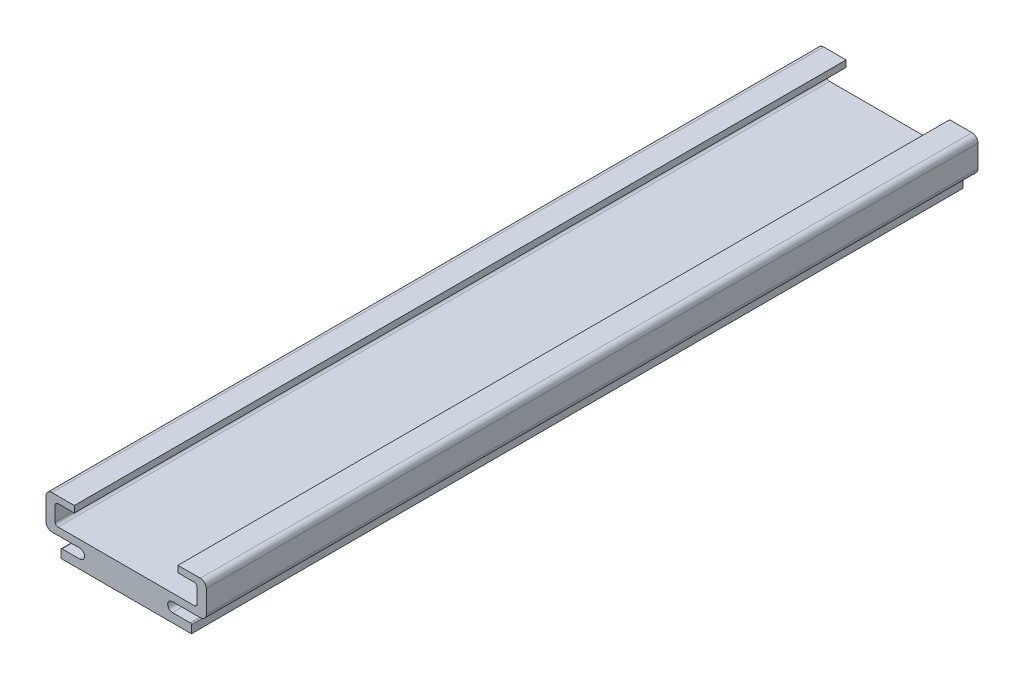
ISO-10303-21;
HEADER;
FILE_DESCRIPTION(('STEP AP214'),'2;1');
FILE_NAME('part.step','',(''),(''),'','','');
FILE_SCHEMA(('AUTOMOTIVE_DESIGN { 1 0 10303 214 1 1 1 1 }'));
ENDSEC;
DATA;
#1=APPLICATION_CONTEXT('core data for automotive mechanical design processes');
#2=APPLICATION_PROTOCOL_DEFINITION('international standard','automotive_design',2000,#1);
#3=PRODUCT_CONTEXT('',#1,'mechanical');
#4=PRODUCT('Part','Part','',(#3));
#5=PRODUCT_RELATED_PRODUCT_CATEGORY('part','',(#4));
#6=PRODUCT_DEFINITION_FORMATION('','',#4);
#7=PRODUCT_DEFINITION_CONTEXT('part definition',#1,'design');
#8=PRODUCT_DEFINITION('design','',#6,#7);
#9=PRODUCT_DEFINITION_SHAPE('','',#8);
#10=(LENGTH_UNIT() NAMED_UNIT(*) SI_UNIT(.MILLI.,.METRE.));
#11=(NAMED_UNIT(*) PLANE_ANGLE_UNIT() SI_UNIT($,.RADIAN.));
#12=(NAMED_UNIT(*) SI_UNIT($,.STERADIAN.) SOLID_ANGLE_UNIT());
#13=UNCERTAINTY_MEASURE_WITH_UNIT(LENGTH_MEASURE(1.E-05),#10,'distance_accuracy_value','');
#14=(GEOMETRIC_REPRESENTATION_CONTEXT(3) GLOBAL_UNCERTAINTY_ASSIGNED_CONTEXT((#13)) GLOBAL_UNIT_ASSIGNED_CONTEXT((#10,
#11,#12)) REPRESENTATION_CONTEXT('',''));
#15=CARTESIAN_POINT('',(0.,0.,0.));
#16=DIRECTION('',(0.,0.,1.));
#17=DIRECTION('',(1.,0.,0.));
#18=AXIS2_PLACEMENT_3D('',#15,#16,#17);
#19=CARTESIAN_POINT('',(-10.8,1.3,0.));
#20=DIRECTION('',(0.,0.,-1.));
#21=DIRECTION('',(-1.,0.,0.));
#22=AXIS2_PLACEMENT_3D('',#19,#20,#21);
#23=CYLINDRICAL_SURFACE('',#22,0.2);
#24=CARTESIAN_POINT('',(-10.8,1.3,0.));
#25=DIRECTION('',(0.,0.,-1.));
#26=DIRECTION('',(-1.,0.,0.));
#27=AXIS2_PLACEMENT_3D('',#24,#25,#26);
#28=CIRCLE('',#27,0.2);
#29=CARTESIAN_POINT('',(-11.,1.3,0.));
#30=VERTEX_POINT('',#29);
#31=CARTESIAN_POINT('',(-10.8,1.5,0.));
#32=VERTEX_POINT('',#31);
#33=EDGE_CURVE('E294',#30,#32,#28,.T.);
#34=ORIENTED_EDGE('',*,*,#33,.T.);
#35=DIRECTION('',(0.,0.,1.));
#36=VECTOR('',#35,1.);
#37=CARTESIAN_POINT('',(-10.8,1.5,0.));
#38=LINE('',#37,#36);
#39=CARTESIAN_POINT('',(-10.8,1.5,-130.));
#40=VERTEX_POINT('',#39);
#41=EDGE_CURVE('E303',#40,#32,#38,.T.);
#42=ORIENTED_EDGE('',*,*,#41,.F.);
#43=CARTESIAN_POINT('',(-10.8,1.3,-130.));
#44=DIRECTION('',(0.,0.,-1.));
#45=DIRECTION('',(-1.,0.,0.));
#46=AXIS2_PLACEMENT_3D('',#43,#44,#45);
#47=CIRCLE('',#46,0.2);
#48=CARTESIAN_POINT('',(-11.,1.3,-130.));
#49=VERTEX_POINT('',#48);
#50=EDGE_CURVE('E20',#40,#49,#47,.F.);
#51=ORIENTED_EDGE('',*,*,#50,.T.);
#52=DIRECTION('',(0.,0.,1.));
#53=VECTOR('',#52,1.);
#54=CARTESIAN_POINT('',(-11.,1.3,0.));
#55=LINE('',#54,#53);
#56=EDGE_CURVE('E301',#30,#49,#55,.F.);
#57=ORIENTED_EDGE('',*,*,#56,.F.);
#58=EDGE_LOOP('',(#34,#42,#51,#57));
#59=FACE_BOUND('',#58,.T.);
#60=ADVANCED_FACE('F17',(#59),#23,.T.);
#61=CARTESIAN_POINT('',(11.,1.5,0.));
#62=DIRECTION('',(-1.,0.,0.));
#63=DIRECTION('',(0.,0.,1.));
#64=AXIS2_PLACEMENT_3D('',#61,#62,#63);
#65=PLANE('',#64);
#66=DIRECTION('',(0.,1.,0.));
#67=VECTOR('',#66,1.);
#68=CARTESIAN_POINT('',(11.,1.5,0.));
#69=LINE('',#68,#67);
#70=CARTESIAN_POINT('',(11.,0.,0.));
#71=VERTEX_POINT('',#70);
#72=CARTESIAN_POINT('',(11.,1.3,0.));
#73=VERTEX_POINT('',#72);
#74=EDGE_CURVE('E299',#71,#73,#69,.T.);
#75=ORIENTED_EDGE('',*,*,#74,.F.);
#76=DIRECTION('',(0.,0.,-1.));
#77=VECTOR('',#76,1.);
#78=CARTESIAN_POINT('',(11.,0.,0.));
#79=LINE('',#78,#77);
#80=CARTESIAN_POINT('',(11.,0.,-130.));
#81=VERTEX_POINT('',#80);
#82=EDGE_CURVE('E322',#81,#71,#79,.F.);
#83=ORIENTED_EDGE('',*,*,#82,.F.);
#84=DIRECTION('',(0.,1.,0.));
#85=VECTOR('',#84,1.);
#86=CARTESIAN_POINT('',(11.,1.5,-130.));
#87=LINE('',#86,#85);
#88=CARTESIAN_POINT('',(11.,1.3,-130.));
#89=VERTEX_POINT('',#88);
#90=EDGE_CURVE('E295',#89,#81,#87,.F.);
#91=ORIENTED_EDGE('',*,*,#90,.F.);
#92=DIRECTION('',(0.,0.,1.));
#93=VECTOR('',#92,1.);
#94=CARTESIAN_POINT('',(11.,1.3,0.));
#95=LINE('',#94,#93);
#96=EDGE_CURVE('E288',#73,#89,#95,.F.);
#97=ORIENTED_EDGE('',*,*,#96,.F.);
#98=EDGE_LOOP('',(#75,#83,#91,#97));
#99=FACE_BOUND('',#98,.T.);
#100=ADVANCED_FACE('F379',(#99),#65,.F.);
#101=CARTESIAN_POINT('',(-11.,1.5,0.));
#102=DIRECTION('',(-1.,0.,0.));
#103=DIRECTION('',(0.,0.,1.));
#104=AXIS2_PLACEMENT_3D('',#101,#102,#103);
#105=PLANE('',#104);
#106=DIRECTION('',(0.,0.,-1.));
#107=VECTOR('',#106,1.);
#108=CARTESIAN_POINT('',(-11.,0.,0.));
#109=LINE('',#108,#107);
#110=CARTESIAN_POINT('',(-11.,0.,0.));
#111=VERTEX_POINT('',#110);
#112=CARTESIAN_POINT('',(-11.,0.,-130.));
#113=VERTEX_POINT('',#112);
#114=EDGE_CURVE('E319',#111,#113,#109,.T.);
#115=ORIENTED_EDGE('',*,*,#114,.F.);
#116=DIRECTION('',(0.,1.,0.));
#117=VECTOR('',#116,1.);
#118=CARTESIAN_POINT('',(-11.,1.5,0.));
#119=LINE('',#118,#117);
#120=EDGE_CURVE('E293',#111,#30,#119,.T.);
#121=ORIENTED_EDGE('',*,*,#120,.T.);
#122=ORIENTED_EDGE('',*,*,#56,.T.);
#123=DIRECTION('',(0.,1.,0.));
#124=VECTOR('',#123,1.);
#125=CARTESIAN_POINT('',(-11.,1.5,-130.));
#126=LINE('',#125,#124);
#127=EDGE_CURVE('E191',#49,#113,#126,.F.);
#128=ORIENTED_EDGE('',*,*,#127,.T.);
#129=EDGE_LOOP('',(#115,#121,#122,#128));
#130=FACE_BOUND('',#129,.T.);
#131=ADVANCED_FACE('F309',(#130),#105,.T.);
#132=CARTESIAN_POINT('',(10.8,1.3,0.));
#133=DIRECTION('',(0.,0.,1.));
#134=DIRECTION('',(1.,0.,0.));
#135=AXIS2_PLACEMENT_3D('',#132,#133,#134);
#136=CYLINDRICAL_SURFACE('',#135,0.2);
#137=CARTESIAN_POINT('',(10.8,1.3,0.));
#138=DIRECTION('',(0.,0.,1.));
#139=DIRECTION('',(1.,0.,0.));
#140=AXIS2_PLACEMENT_3D('',#137,#138,#139);
#141=CIRCLE('',#140,0.2);
#142=CARTESIAN_POINT('',(10.8,1.5,0.));
#143=VERTEX_POINT('',#142);
#144=EDGE_CURVE('E289',#143,#73,#141,.F.);
#145=ORIENTED_EDGE('',*,*,#144,.T.);
#146=ORIENTED_EDGE('',*,*,#96,.T.);
#147=CARTESIAN_POINT('',(10.8,1.3,-130.));
#148=DIRECTION('',(0.,0.,1.));
#149=DIRECTION('',(1.,0.,0.));
#150=AXIS2_PLACEMENT_3D('',#147,#148,#149);
#151=CIRCLE('',#150,0.2);
#152=CARTESIAN_POINT('',(10.8,1.5,-130.));
#153=VERTEX_POINT('',#152);
#154=EDGE_CURVE('E292',#89,#153,#151,.T.);
#155=ORIENTED_EDGE('',*,*,#154,.T.);
#156=DIRECTION('',(0.,0.,1.));
#157=VECTOR('',#156,1.);
#158=CARTESIAN_POINT('',(10.8,1.5,0.));
#159=LINE('',#158,#157);
#160=EDGE_CURVE('E321',#153,#143,#159,.T.);
#161=ORIENTED_EDGE('',*,*,#160,.T.);
#162=EDGE_LOOP('',(#145,#146,#155,#161));
#163=FACE_BOUND('',#162,.T.);
#164=ADVANCED_FACE('F374',(#163),#136,.T.);
#165=CARTESIAN_POINT('',(12.5,4.1,0.));
#166=DIRECTION('',(0.,0.,1.));
#167=DIRECTION('',(1.,0.,0.));
#168=AXIS2_PLACEMENT_3D('',#165,#166,#167);
#169=CYLINDRICAL_SURFACE('',#168,1.);
#170=CARTESIAN_POINT('',(12.5,4.1,0.));
#171=DIRECTION('',(0.,0.,1.));
#172=DIRECTION('',(1.,0.,0.));
#173=AXIS2_PLACEMENT_3D('',#170,#171,#172);
#174=CIRCLE('',#173,1.);
#175=CARTESIAN_POINT('',(13.5,4.1,0.));
#176=VERTEX_POINT('',#175);
#177=CARTESIAN_POINT('',(12.5,3.1,0.));
#178=VERTEX_POINT('',#177);
#179=EDGE_CURVE('E284',#176,#178,#174,.F.);
#180=ORIENTED_EDGE('',*,*,#179,.T.);
#181=DIRECTION('',(0.,0.,1.));
#182=VECTOR('',#181,1.);
#183=CARTESIAN_POINT('',(12.5,3.1,0.));
#184=LINE('',#183,#182);
#185=CARTESIAN_POINT('',(12.5,3.1,-130.));
#186=VERTEX_POINT('',#185);
#187=EDGE_CURVE('E484',#178,#186,#184,.F.);
#188=ORIENTED_EDGE('',*,*,#187,.T.);
#189=CARTESIAN_POINT('',(12.5,4.1,-130.));
#190=DIRECTION('',(0.,0.,1.));
#191=DIRECTION('',(1.,0.,0.));
#192=AXIS2_PLACEMENT_3D('',#189,#190,#191);
#193=CIRCLE('',#192,1.);
#194=CARTESIAN_POINT('',(13.5,4.1,-130.));
#195=VERTEX_POINT('',#194);
#196=EDGE_CURVE('E286',#186,#195,#193,.T.);
#197=ORIENTED_EDGE('',*,*,#196,.T.);
#198=DIRECTION('',(0.,0.,1.));
#199=VECTOR('',#198,1.);
#200=CARTESIAN_POINT('',(13.5,4.1,0.));
#201=LINE('',#200,#199);
#202=EDGE_CURVE('E476',#195,#176,#201,.T.);
#203=ORIENTED_EDGE('',*,*,#202,.T.);
#204=EDGE_LOOP('',(#180,#188,#197,#203));
#205=FACE_BOUND('',#204,.T.);
#206=ADVANCED_FACE('F568',(#205),#169,.T.);
#207=CARTESIAN_POINT('',(12.5,7.86,0.));
#208=DIRECTION('',(0.,0.,1.));
#209=DIRECTION('',(1.,0.,0.));
#210=AXIS2_PLACEMENT_3D('',#207,#208,#209);
#211=CYLINDRICAL_SURFACE('',#210,1.);
#212=CARTESIAN_POINT('',(12.5,7.86,0.));
#213=DIRECTION('',(0.,0.,1.));
#214=DIRECTION('',(1.,0.,0.));
#215=AXIS2_PLACEMENT_3D('',#212,#213,#214);
#216=CIRCLE('',#215,1.);
#217=CARTESIAN_POINT('',(12.5,8.86,0.));
#218=VERTEX_POINT('',#217);
#219=CARTESIAN_POINT('',(13.5,7.86,0.));
#220=VERTEX_POINT('',#219);
#221=EDGE_CURVE('E279',#218,#220,#216,.F.);
#222=ORIENTED_EDGE('',*,*,#221,.T.);
#223=DIRECTION('',(0.,0.,1.));
#224=VECTOR('',#223,1.);
#225=CARTESIAN_POINT('',(13.5,7.86,0.));
#226=LINE('',#225,#224);
#227=CARTESIAN_POINT('',(13.5,7.86,-130.));
#228=VERTEX_POINT('',#227);
#229=EDGE_CURVE('E481',#220,#228,#226,.F.);
#230=ORIENTED_EDGE('',*,*,#229,.T.);
#231=CARTESIAN_POINT('',(12.5,7.86,-130.));
#232=DIRECTION('',(0.,0.,1.));
#233=DIRECTION('',(1.,0.,0.));
#234=AXIS2_PLACEMENT_3D('',#231,#232,#233);
#235=CIRCLE('',#234,1.);
#236=CARTESIAN_POINT('',(12.5,8.86,-130.));
#237=VERTEX_POINT('',#236);
#238=EDGE_CURVE('E282',#228,#237,#235,.T.);
#239=ORIENTED_EDGE('',*,*,#238,.T.);
#240=DIRECTION('',(0.,0.,1.));
#241=VECTOR('',#240,1.);
#242=CARTESIAN_POINT('',(12.5,8.86,0.));
#243=LINE('',#242,#241);
#244=EDGE_CURVE('E468',#237,#218,#243,.T.);
#245=ORIENTED_EDGE('',*,*,#244,.T.);
#246=EDGE_LOOP('',(#222,#230,#239,#245));
#247=FACE_BOUND('',#246,.T.);
#248=ADVANCED_FACE('F574',(#247),#211,.T.);
#249=CARTESIAN_POINT('',(8.725,7.76,0.));
#250=DIRECTION('',(1.,0.,0.));
#251=DIRECTION('',(0.,1.,0.));
#252=AXIS2_PLACEMENT_3D('',#249,#250,#251);
#253=PLANE('',#252);
#254=DIRECTION('',(0.,0.,1.));
#255=VECTOR('',#254,1.);
#256=CARTESIAN_POINT('',(8.725,7.76,0.));
#257=LINE('',#256,#255);
#258=CARTESIAN_POINT('',(8.725,7.76,-130.));
#259=VERTEX_POINT('',#258);
#260=CARTESIAN_POINT('',(8.725,7.76,0.));
#261=VERTEX_POINT('',#260);
#262=EDGE_CURVE('E465',#259,#261,#257,.T.);
#263=ORIENTED_EDGE('',*,*,#262,.T.);
#264=DIRECTION('',(0.,1.,0.));
#265=VECTOR('',#264,1.);
#266=CARTESIAN_POINT('',(8.725,7.76,0.));
#267=LINE('',#266,#265);
#268=CARTESIAN_POINT('',(8.725,8.86,0.));
#269=VERTEX_POINT('',#268);
#270=EDGE_CURVE('E281',#269,#261,#267,.F.);
#271=ORIENTED_EDGE('',*,*,#270,.F.);
#272=DIRECTION('',(0.,0.,1.));
#273=VECTOR('',#272,1.);
#274=CARTESIAN_POINT('',(8.725,8.86,0.));
#275=LINE('',#274,#273);
#276=CARTESIAN_POINT('',(8.725,8.86,-130.));
#277=VERTEX_POINT('',#276);
#278=EDGE_CURVE('E473',#269,#277,#275,.F.);
#279=ORIENTED_EDGE('',*,*,#278,.T.);
#280=DIRECTION('',(0.,1.,0.));
#281=VECTOR('',#280,1.);
#282=CARTESIAN_POINT('',(8.725,7.76,-130.));
#283=LINE('',#282,#281);
#284=EDGE_CURVE('E278',#259,#277,#283,.T.);
#285=ORIENTED_EDGE('',*,*,#284,.F.);
#286=EDGE_LOOP('',(#263,#271,#279,#285));
#287=FACE_BOUND('',#286,.T.);
#288=ADVANCED_FACE('F584',(#287),#253,.F.);
#289=CARTESIAN_POINT('',(11.475,7.26,0.));
#290=DIRECTION('',(0.,0.,1.));
#291=DIRECTION('',(1.,0.,0.));
#292=AXIS2_PLACEMENT_3D('',#289,#290,#291);
#293=CYLINDRICAL_SURFACE('',#292,0.5);
#294=DIRECTION('',(0.,0.,1.));
#295=VECTOR('',#294,1.);
#296=CARTESIAN_POINT('',(11.475,7.76,0.));
#297=LINE('',#296,#295);
#298=CARTESIAN_POINT('',(11.475,7.76,0.));
#299=VERTEX_POINT('',#298);
#300=CARTESIAN_POINT('',(11.475,7.76,-130.));
#301=VERTEX_POINT('',#300);
#302=EDGE_CURVE('E462',#299,#301,#297,.F.);
#303=ORIENTED_EDGE('',*,*,#302,.T.);
#304=CARTESIAN_POINT('',(11.475,7.26,-130.));
#305=DIRECTION('',(0.,0.,1.));
#306=DIRECTION('',(1.,0.,0.));
#307=AXIS2_PLACEMENT_3D('',#304,#305,#306);
#308=CIRCLE('',#307,0.5);
#309=CARTESIAN_POINT('',(11.975,7.26,-130.));
#310=VERTEX_POINT('',#309);
#311=EDGE_CURVE('E276',#310,#301,#308,.T.);
#312=ORIENTED_EDGE('',*,*,#311,.F.);
#313=DIRECTION('',(0.,0.,-1.));
#314=VECTOR('',#313,1.);
#315=CARTESIAN_POINT('',(11.975,7.26,0.));
#316=LINE('',#315,#314);
#317=CARTESIAN_POINT('',(11.975,7.26,0.));
#318=VERTEX_POINT('',#317);
#319=EDGE_CURVE('E217',#310,#318,#316,.F.);
#320=ORIENTED_EDGE('',*,*,#319,.T.);
#321=CARTESIAN_POINT('',(11.475,7.26,0.));
#322=DIRECTION('',(0.,0.,1.));
#323=DIRECTION('',(1.,0.,0.));
#324=AXIS2_PLACEMENT_3D('',#321,#322,#323);
#325=CIRCLE('',#324,0.5);
#326=EDGE_CURVE('E274',#299,#318,#325,.F.);
#327=ORIENTED_EDGE('',*,*,#326,.F.);
#328=EDGE_LOOP('',(#303,#312,#320,#327));
#329=FACE_BOUND('',#328,.T.);
#330=ADVANCED_FACE('F630',(#329),#293,.F.);
#331=CARTESIAN_POINT('',(-11.475,7.26,0.));
#332=DIRECTION('',(0.,0.,-1.));
#333=DIRECTION('',(-1.,0.,0.));
#334=AXIS2_PLACEMENT_3D('',#331,#332,#333);
#335=CYLINDRICAL_SURFACE('',#334,0.5);
#336=DIRECTION('',(0.,0.,-1.));
#337=VECTOR('',#336,1.);
#338=CARTESIAN_POINT('',(-11.975,7.26,0.));
#339=LINE('',#338,#337);
#340=CARTESIAN_POINT('',(-11.975,7.26,-130.));
#341=VERTEX_POINT('',#340);
#342=CARTESIAN_POINT('',(-11.975,7.26,0.));
#343=VERTEX_POINT('',#342);
#344=EDGE_CURVE('E453',#341,#343,#339,.F.);
#345=ORIENTED_EDGE('',*,*,#344,.F.);
#346=CARTESIAN_POINT('',(-11.475,7.26,-130.));
#347=DIRECTION('',(0.,0.,-1.));
#348=DIRECTION('',(-1.,0.,0.));
#349=AXIS2_PLACEMENT_3D('',#346,#347,#348);
#350=CIRCLE('',#349,0.5);
#351=CARTESIAN_POINT('',(-11.475,7.76,-130.));
#352=VERTEX_POINT('',#351);
#353=EDGE_CURVE('E272',#352,#341,#350,.F.);
#354=ORIENTED_EDGE('',*,*,#353,.F.);
#355=DIRECTION('',(0.,0.,1.));
#356=VECTOR('',#355,1.);
#357=CARTESIAN_POINT('',(-11.475,7.76,0.));
#358=LINE('',#357,#356);
#359=CARTESIAN_POINT('',(-11.475,7.76,0.));
#360=VERTEX_POINT('',#359);
#361=EDGE_CURVE('E450',#360,#352,#358,.F.);
#362=ORIENTED_EDGE('',*,*,#361,.F.);
#363=CARTESIAN_POINT('',(-11.475,7.26,0.));
#364=DIRECTION('',(0.,0.,-1.));
#365=DIRECTION('',(-1.,0.,0.));
#366=AXIS2_PLACEMENT_3D('',#363,#364,#365);
#367=CIRCLE('',#366,0.5);
#368=EDGE_CURVE('E269',#343,#360,#367,.T.);
#369=ORIENTED_EDGE('',*,*,#368,.F.);
#370=EDGE_LOOP('',(#345,#354,#362,#369));
#371=FACE_BOUND('',#370,.T.);
#372=ADVANCED_FACE('F608',(#371),#335,.F.);
#373=CARTESIAN_POINT('',(-8.725,7.76,0.));
#374=DIRECTION('',(1.,0.,0.));
#375=DIRECTION('',(0.,1.,0.));
#376=AXIS2_PLACEMENT_3D('',#373,#374,#375);
#377=PLANE('',#376);
#378=DIRECTION('',(0.,1.,0.));
#379=VECTOR('',#378,1.);
#380=CARTESIAN_POINT('',(-8.725,7.76,0.));
#381=LINE('',#380,#379);
#382=CARTESIAN_POINT('',(-8.725,8.86,0.));
#383=VERTEX_POINT('',#382);
#384=CARTESIAN_POINT('',(-8.725,7.76,0.));
#385=VERTEX_POINT('',#384);
#386=EDGE_CURVE('E268',#383,#385,#381,.F.);
#387=ORIENTED_EDGE('',*,*,#386,.T.);
#388=DIRECTION('',(0.,0.,1.));
#389=VECTOR('',#388,1.);
#390=CARTESIAN_POINT('',(-8.725,7.76,0.));
#391=LINE('',#390,#389);
#392=CARTESIAN_POINT('',(-8.725,7.76,-130.));
#393=VERTEX_POINT('',#392);
#394=EDGE_CURVE('E445',#393,#385,#391,.T.);
#395=ORIENTED_EDGE('',*,*,#394,.F.);
#396=DIRECTION('',(0.,1.,0.));
#397=VECTOR('',#396,1.);
#398=CARTESIAN_POINT('',(-8.725,7.76,-130.));
#399=LINE('',#398,#397);
#400=CARTESIAN_POINT('',(-8.725,8.86,-130.));
#401=VERTEX_POINT('',#400);
#402=EDGE_CURVE('E271',#393,#401,#399,.T.);
#403=ORIENTED_EDGE('',*,*,#402,.T.);
#404=DIRECTION('',(0.,0.,1.));
#405=VECTOR('',#404,1.);
#406=CARTESIAN_POINT('',(-8.725,8.86,0.));
#407=LINE('',#406,#405);
#408=EDGE_CURVE('E441',#383,#401,#407,.F.);
#409=ORIENTED_EDGE('',*,*,#408,.F.);
#410=EDGE_LOOP('',(#387,#395,#403,#409));
#411=FACE_BOUND('',#410,.T.);
#412=ADVANCED_FACE('F599',(#411),#377,.T.);
#413=CARTESIAN_POINT('',(-12.5,4.1,0.));
#414=DIRECTION('',(0.,0.,-1.));
#415=DIRECTION('',(-1.,0.,0.));
#416=AXIS2_PLACEMENT_3D('',#413,#414,#415);
#417=CYLINDRICAL_SURFACE('',#416,1.);
#418=CARTESIAN_POINT('',(-12.5,4.1,0.));
#419=DIRECTION('',(0.,0.,-1.));
#420=DIRECTION('',(-1.,0.,0.));
#421=AXIS2_PLACEMENT_3D('',#418,#419,#420);
#422=CIRCLE('',#421,1.);
#423=CARTESIAN_POINT('',(-12.5,3.1,0.));
#424=VERTEX_POINT('',#423);
#425=CARTESIAN_POINT('',(-13.5,4.1,0.));
#426=VERTEX_POINT('',#425);
#427=EDGE_CURVE('E264',#424,#426,#422,.T.);
#428=ORIENTED_EDGE('',*,*,#427,.T.);
#429=DIRECTION('',(0.,0.,1.));
#430=VECTOR('',#429,1.);
#431=CARTESIAN_POINT('',(-13.5,4.1,0.));
#432=LINE('',#431,#430);
#433=CARTESIAN_POINT('',(-13.5,4.1,-130.));
#434=VERTEX_POINT('',#433);
#435=EDGE_CURVE('E438',#434,#426,#432,.T.);
#436=ORIENTED_EDGE('',*,*,#435,.F.);
#437=CARTESIAN_POINT('',(-12.5,4.1,-130.));
#438=DIRECTION('',(0.,0.,-1.));
#439=DIRECTION('',(-1.,0.,0.));
#440=AXIS2_PLACEMENT_3D('',#437,#438,#439);
#441=CIRCLE('',#440,1.);
#442=CARTESIAN_POINT('',(-12.5,3.1,-130.));
#443=VERTEX_POINT('',#442);
#444=EDGE_CURVE('E266',#434,#443,#441,.F.);
#445=ORIENTED_EDGE('',*,*,#444,.T.);
#446=DIRECTION('',(0.,0.,1.));
#447=VECTOR('',#446,1.);
#448=CARTESIAN_POINT('',(-12.5,3.1,0.));
#449=LINE('',#448,#447);
#450=EDGE_CURVE('E261',#424,#443,#449,.F.);
#451=ORIENTED_EDGE('',*,*,#450,.F.);
#452=EDGE_LOOP('',(#428,#436,#445,#451));
#453=FACE_BOUND('',#452,.T.);
#454=ADVANCED_FACE('F713',(#453),#417,.T.);
#455=CARTESIAN_POINT('',(-12.5,7.86,0.));
#456=DIRECTION('',(0.,0.,-1.));
#457=DIRECTION('',(-1.,0.,0.));
#458=AXIS2_PLACEMENT_3D('',#455,#456,#457);
#459=CYLINDRICAL_SURFACE('',#458,1.);
#460=CARTESIAN_POINT('',(-12.5,7.86,0.));
#461=DIRECTION('',(0.,0.,-1.));
#462=DIRECTION('',(-1.,0.,0.));
#463=AXIS2_PLACEMENT_3D('',#460,#461,#462);
#464=CIRCLE('',#463,1.);
#465=CARTESIAN_POINT('',(-13.5,7.86,0.));
#466=VERTEX_POINT('',#465);
#467=CARTESIAN_POINT('',(-12.5,8.86,0.));
#468=VERTEX_POINT('',#467);
#469=EDGE_CURVE('E259',#466,#468,#464,.T.);
#470=ORIENTED_EDGE('',*,*,#469,.T.);
#471=DIRECTION('',(0.,0.,1.));
#472=VECTOR('',#471,1.);
#473=CARTESIAN_POINT('',(-12.5,8.86,0.));
#474=LINE('',#473,#472);
#475=CARTESIAN_POINT('',(-12.5,8.86,-130.));
#476=VERTEX_POINT('',#475);
#477=EDGE_CURVE('E442',#476,#468,#474,.T.);
#478=ORIENTED_EDGE('',*,*,#477,.F.);
#479=CARTESIAN_POINT('',(-12.5,7.86,-130.));
#480=DIRECTION('',(0.,0.,-1.));
#481=DIRECTION('',(-1.,0.,0.));
#482=AXIS2_PLACEMENT_3D('',#479,#480,#481);
#483=CIRCLE('',#482,1.);
#484=CARTESIAN_POINT('',(-13.5,7.86,-130.));
#485=VERTEX_POINT('',#484);
#486=EDGE_CURVE('E262',#476,#485,#483,.F.);
#487=ORIENTED_EDGE('',*,*,#486,.T.);
#488=DIRECTION('',(0.,0.,1.));
#489=VECTOR('',#488,1.);
#490=CARTESIAN_POINT('',(-13.5,7.86,0.));
#491=LINE('',#490,#489);
#492=EDGE_CURVE('E435',#466,#485,#491,.F.);
#493=ORIENTED_EDGE('',*,*,#492,.F.);
#494=EDGE_LOOP('',(#470,#478,#487,#493));
#495=FACE_BOUND('',#494,.T.);
#496=ADVANCED_FACE('F721',(#495),#459,.T.);
#497=CARTESIAN_POINT('',(-13.5,3.1,0.));
#498=DIRECTION('',(0.,-1.,0.));
#499=DIRECTION('',(1.,0.,0.));
#500=AXIS2_PLACEMENT_3D('',#497,#498,#499);
#501=PLANE('',#500);
#502=DIRECTION('',(0.,0.,-1.));
#503=VECTOR('',#502,1.);
#504=CARTESIAN_POINT('',(-7.8,3.1,0.));
#505=LINE('',#504,#503);
#506=CARTESIAN_POINT('',(-7.8,3.1,-130.));
#507=VERTEX_POINT('',#506);
#508=CARTESIAN_POINT('',(-7.8,3.1,0.));
#509=VERTEX_POINT('',#508);
#510=EDGE_CURVE('E345',#507,#509,#505,.F.);
#511=ORIENTED_EDGE('',*,*,#510,.T.);
#512=DIRECTION('',(1.,0.,0.));
#513=VECTOR('',#512,1.);
#514=CARTESIAN_POINT('',(-8.07791371977014,3.1,0.));
#515=LINE('',#514,#513);
#516=EDGE_CURVE('E258',#424,#509,#515,.T.);
#517=ORIENTED_EDGE('',*,*,#516,.F.);
#518=ORIENTED_EDGE('',*,*,#450,.T.);
#519=DIRECTION('',(1.,0.,0.));
#520=VECTOR('',#519,1.);
#521=CARTESIAN_POINT('',(-8.07791371977014,3.1,-130.));
#522=LINE('',#521,#520);
#523=EDGE_CURVE('E242',#443,#507,#522,.T.);
#524=ORIENTED_EDGE('',*,*,#523,.T.);
#525=EDGE_LOOP('',(#511,#517,#518,#524));
#526=FACE_BOUND('',#525,.T.);
#527=ADVANCED_FACE('F731',(#526),#501,.T.);
#528=CARTESIAN_POINT('',(-7.8,2.3,0.));
#529=DIRECTION('',(0.,0.,-1.));
#530=DIRECTION('',(-1.,0.,0.));
#531=AXIS2_PLACEMENT_3D('',#528,#529,#530);
#532=CYLINDRICAL_SURFACE('',#531,0.8);
#533=DIRECTION('',(0.,0.,1.));
#534=VECTOR('',#533,1.);
#535=CARTESIAN_POINT('',(-7.8,1.5,0.));
#536=LINE('',#535,#534);
#537=CARTESIAN_POINT('',(-7.8,1.5,0.));
#538=VERTEX_POINT('',#537);
#539=CARTESIAN_POINT('',(-7.8,1.5,-130.));
#540=VERTEX_POINT('',#539);
#541=EDGE_CURVE('E336',#538,#540,#536,.F.);
#542=ORIENTED_EDGE('',*,*,#541,.F.);
#543=CARTESIAN_POINT('',(-7.8,2.3,0.));
#544=DIRECTION('',(0.,0.,-1.));
#545=DIRECTION('',(-1.,0.,0.));
#546=AXIS2_PLACEMENT_3D('',#543,#544,#545);
#547=CIRCLE('',#546,0.8);
#548=EDGE_CURVE('E254',#509,#538,#547,.T.);
#549=ORIENTED_EDGE('',*,*,#548,.F.);
#550=ORIENTED_EDGE('',*,*,#510,.F.);
#551=CARTESIAN_POINT('',(-7.8,2.3,-130.));
#552=DIRECTION('',(0.,0.,-1.));
#553=DIRECTION('',(-1.,0.,0.));
#554=AXIS2_PLACEMENT_3D('',#551,#552,#553);
#555=CIRCLE('',#554,0.8);
#556=EDGE_CURVE('E239',#507,#540,#555,.T.);
#557=ORIENTED_EDGE('',*,*,#556,.T.);
#558=EDGE_LOOP('',(#542,#549,#550,#557));
#559=FACE_BOUND('',#558,.T.);
#560=ADVANCED_FACE('F505',(#559),#532,.F.);
#561=CARTESIAN_POINT('',(-7.8,1.5,0.));
#562=DIRECTION('',(0.,1.,0.));
#563=DIRECTION('',(-1.,0.,0.));
#564=AXIS2_PLACEMENT_3D('',#561,#562,#563);
#565=PLANE('',#564);
#566=ORIENTED_EDGE('',*,*,#541,.T.);
#567=DIRECTION('',(1.,0.,0.));
#568=VECTOR('',#567,1.);
#569=CARTESIAN_POINT('',(-8.07791371977014,1.5,-130.));
#570=LINE('',#569,#568);
#571=EDGE_CURVE('E241',#540,#40,#570,.F.);
#572=ORIENTED_EDGE('',*,*,#571,.T.);
#573=ORIENTED_EDGE('',*,*,#41,.T.);
#574=DIRECTION('',(1.,0.,0.));
#575=VECTOR('',#574,1.);
#576=CARTESIAN_POINT('',(-8.07791371977014,1.5,0.));
#577=LINE('',#576,#575);
#578=EDGE_CURVE('E257',#538,#32,#577,.F.);
#579=ORIENTED_EDGE('',*,*,#578,.F.);
#580=EDGE_LOOP('',(#566,#572,#573,#579));
#581=FACE_BOUND('',#580,.T.);
#582=ADVANCED_FACE('F496',(#581),#565,.T.);
#583=CARTESIAN_POINT('',(-11.,0.,0.));
#584=DIRECTION('',(0.,-1.,0.));
#585=DIRECTION('',(0.,0.,-1.));
#586=AXIS2_PLACEMENT_3D('',#583,#584,#585);
#587=PLANE('',#586);
#588=DIRECTION('',(1.,0.,0.));
#589=VECTOR('',#588,1.);
#590=CARTESIAN_POINT('',(-8.07791371977014,0.,0.));
#591=LINE('',#590,#589);
#592=EDGE_CURVE('E325',#111,#71,#591,.T.);
#593=ORIENTED_EDGE('',*,*,#592,.F.);
#594=ORIENTED_EDGE('',*,*,#114,.T.);
#595=DIRECTION('',(1.,0.,0.));
#596=VECTOR('',#595,1.);
#597=CARTESIAN_POINT('',(-8.07791371977014,0.,-130.));
#598=LINE('',#597,#596);
#599=EDGE_CURVE('E307',#113,#81,#598,.T.);
#600=ORIENTED_EDGE('',*,*,#599,.T.);
#601=ORIENTED_EDGE('',*,*,#82,.T.);
#602=EDGE_LOOP('',(#593,#594,#600,#601));
#603=FACE_BOUND('',#602,.T.);
#604=ADVANCED_FACE('F494',(#603),#587,.T.);
#605=CARTESIAN_POINT('',(7.8,1.5,0.));
#606=DIRECTION('',(0.,-1.,0.));
#607=DIRECTION('',(1.,0.,0.));
#608=AXIS2_PLACEMENT_3D('',#605,#606,#607);
#609=PLANE('',#608);
#610=DIRECTION('',(1.,0.,0.));
#611=VECTOR('',#610,1.);
#612=CARTESIAN_POINT('',(-8.07791371977014,1.5,-130.));
#613=LINE('',#612,#611);
#614=CARTESIAN_POINT('',(7.8,1.5,-130.));
#615=VERTEX_POINT('',#614);
#616=EDGE_CURVE('E238',#153,#615,#613,.F.);
#617=ORIENTED_EDGE('',*,*,#616,.T.);
#618=DIRECTION('',(0.,0.,1.));
#619=VECTOR('',#618,1.);
#620=CARTESIAN_POINT('',(7.8,1.5,0.));
#621=LINE('',#620,#619);
#622=CARTESIAN_POINT('',(7.8,1.5,0.));
#623=VERTEX_POINT('',#622);
#624=EDGE_CURVE('E487',#615,#623,#621,.T.);
#625=ORIENTED_EDGE('',*,*,#624,.T.);
#626=DIRECTION('',(1.,0.,0.));
#627=VECTOR('',#626,1.);
#628=CARTESIAN_POINT('',(-8.07791371977014,1.5,0.));
#629=LINE('',#628,#627);
#630=EDGE_CURVE('E253',#143,#623,#629,.F.);
#631=ORIENTED_EDGE('',*,*,#630,.F.);
#632=ORIENTED_EDGE('',*,*,#160,.F.);
#633=EDGE_LOOP('',(#617,#625,#631,#632));
#634=FACE_BOUND('',#633,.T.);
#635=ADVANCED_FACE('F491',(#634),#609,.F.);
#636=CARTESIAN_POINT('',(7.8,2.3,0.));
#637=DIRECTION('',(0.,0.,1.));
#638=DIRECTION('',(1.,0.,0.));
#639=AXIS2_PLACEMENT_3D('',#636,#637,#638);
#640=CYLINDRICAL_SURFACE('',#639,0.8);
#641=DIRECTION('',(0.,0.,1.));
#642=VECTOR('',#641,1.);
#643=CARTESIAN_POINT('',(7.8,3.1,0.));
#644=LINE('',#643,#642);
#645=CARTESIAN_POINT('',(7.8,3.1,-130.));
#646=VERTEX_POINT('',#645);
#647=CARTESIAN_POINT('',(7.8,3.1,0.));
#648=VERTEX_POINT('',#647);
#649=EDGE_CURVE('E485',#646,#648,#644,.T.);
#650=ORIENTED_EDGE('',*,*,#649,.T.);
#651=CARTESIAN_POINT('',(7.8,2.3,0.));
#652=DIRECTION('',(0.,0.,1.));
#653=DIRECTION('',(1.,0.,0.));
#654=AXIS2_PLACEMENT_3D('',#651,#652,#653);
#655=CIRCLE('',#654,0.8);
#656=EDGE_CURVE('E249',#623,#648,#655,.F.);
#657=ORIENTED_EDGE('',*,*,#656,.F.);
#658=ORIENTED_EDGE('',*,*,#624,.F.);
#659=CARTESIAN_POINT('',(7.8,2.3,-130.));
#660=DIRECTION('',(0.,0.,1.));
#661=DIRECTION('',(1.,0.,0.));
#662=AXIS2_PLACEMENT_3D('',#659,#660,#661);
#663=CIRCLE('',#662,0.8);
#664=EDGE_CURVE('E235',#615,#646,#663,.F.);
#665=ORIENTED_EDGE('',*,*,#664,.T.);
#666=EDGE_LOOP('',(#650,#657,#658,#665));
#667=FACE_BOUND('',#666,.T.);
#668=ADVANCED_FACE('F503',(#667),#640,.F.);
#669=CARTESIAN_POINT('',(13.5,3.1,0.));
#670=DIRECTION('',(0.,1.,0.));
#671=DIRECTION('',(-1.,0.,0.));
#672=AXIS2_PLACEMENT_3D('',#669,#670,#671);
#673=PLANE('',#672);
#674=DIRECTION('',(1.,0.,0.));
#675=VECTOR('',#674,1.);
#676=CARTESIAN_POINT('',(-8.07791371977014,3.1,0.));
#677=LINE('',#676,#675);
#678=EDGE_CURVE('E252',#648,#178,#677,.T.);
#679=ORIENTED_EDGE('',*,*,#678,.F.);
#680=ORIENTED_EDGE('',*,*,#649,.F.);
#681=DIRECTION('',(1.,0.,0.));
#682=VECTOR('',#681,1.);
#683=CARTESIAN_POINT('',(-8.07791371977014,3.1,-130.));
#684=LINE('',#683,#682);
#685=EDGE_CURVE('E237',#646,#186,#684,.T.);
#686=ORIENTED_EDGE('',*,*,#685,.T.);
#687=ORIENTED_EDGE('',*,*,#187,.F.);
#688=EDGE_LOOP('',(#679,#680,#686,#687));
#689=FACE_BOUND('',#688,.T.);
#690=ADVANCED_FACE('F552',(#689),#673,.F.);
#691=CARTESIAN_POINT('',(13.5,8.86,0.));
#692=DIRECTION('',(-1.,0.,0.));
#693=DIRECTION('',(0.,0.,1.));
#694=AXIS2_PLACEMENT_3D('',#691,#692,#693);
#695=PLANE('',#694);
#696=DIRECTION('',(0.,1.,0.));
#697=VECTOR('',#696,1.);
#698=CARTESIAN_POINT('',(13.5,3.8044664990915,-130.));
#699=LINE('',#698,#697);
#700=EDGE_CURVE('E572',#195,#228,#699,.T.);
#701=ORIENTED_EDGE('',*,*,#700,.T.);
#702=ORIENTED_EDGE('',*,*,#229,.F.);
#703=DIRECTION('',(0.,1.,0.));
#704=VECTOR('',#703,1.);
#705=CARTESIAN_POINT('',(13.5,3.8044664990915,0.));
#706=LINE('',#705,#704);
#707=EDGE_CURVE('E422',#176,#220,#706,.T.);
#708=ORIENTED_EDGE('',*,*,#707,.F.);
#709=ORIENTED_EDGE('',*,*,#202,.F.);
#710=EDGE_LOOP('',(#701,#702,#708,#709));
#711=FACE_BOUND('',#710,.T.);
#712=ADVANCED_FACE('F548',(#711),#695,.F.);
#713=CARTESIAN_POINT('',(8.725,8.86,0.));
#714=DIRECTION('',(0.,-1.,0.));
#715=DIRECTION('',(1.,0.,0.));
#716=AXIS2_PLACEMENT_3D('',#713,#714,#715);
#717=PLANE('',#716);
#718=DIRECTION('',(1.,0.,0.));
#719=VECTOR('',#718,1.);
#720=CARTESIAN_POINT('',(-8.07791371977014,8.86,-130.));
#721=LINE('',#720,#719);
#722=EDGE_CURVE('E581',#237,#277,#721,.F.);
#723=ORIENTED_EDGE('',*,*,#722,.T.);
#724=ORIENTED_EDGE('',*,*,#278,.F.);
#725=DIRECTION('',(1.,0.,0.));
#726=VECTOR('',#725,1.);
#727=CARTESIAN_POINT('',(-8.07791371977014,8.86,0.));
#728=LINE('',#727,#726);
#729=EDGE_CURVE('E417',#218,#269,#728,.F.);
#730=ORIENTED_EDGE('',*,*,#729,.F.);
#731=ORIENTED_EDGE('',*,*,#244,.F.);
#732=EDGE_LOOP('',(#723,#724,#730,#731));
#733=FACE_BOUND('',#732,.T.);
#734=ADVANCED_FACE('F544',(#733),#717,.F.);
#735=CARTESIAN_POINT('',(11.975,7.76,0.));
#736=DIRECTION('',(0.,1.,0.));
#737=DIRECTION('',(-1.,0.,0.));
#738=AXIS2_PLACEMENT_3D('',#735,#736,#737);
#739=PLANE('',#738);
#740=DIRECTION('',(1.,0.,0.));
#741=VECTOR('',#740,1.);
#742=CARTESIAN_POINT('',(-8.07791371977014,7.76,0.));
#743=LINE('',#742,#741);
#744=EDGE_CURVE('E414',#261,#299,#743,.T.);
#745=ORIENTED_EDGE('',*,*,#744,.F.);
#746=ORIENTED_EDGE('',*,*,#262,.F.);
#747=DIRECTION('',(1.,0.,0.));
#748=VECTOR('',#747,1.);
#749=CARTESIAN_POINT('',(-8.07791371977014,7.76,-130.));
#750=LINE('',#749,#748);
#751=EDGE_CURVE('E218',#259,#301,#750,.T.);
#752=ORIENTED_EDGE('',*,*,#751,.T.);
#753=ORIENTED_EDGE('',*,*,#302,.F.);
#754=EDGE_LOOP('',(#745,#746,#752,#753));
#755=FACE_BOUND('',#754,.T.);
#756=ADVANCED_FACE('F541',(#755),#739,.F.);
#757=CARTESIAN_POINT('',(11.975,4.35,0.));
#758=DIRECTION('',(1.,0.,0.));
#759=DIRECTION('',(0.,0.,-1.));
#760=AXIS2_PLACEMENT_3D('',#757,#758,#759);
#761=PLANE('',#760);
#762=DIRECTION('',(0.,1.,0.));
#763=VECTOR('',#762,1.);
#764=CARTESIAN_POINT('',(11.975,3.8044664990915,-130.));
#765=LINE('',#764,#763);
#766=CARTESIAN_POINT('',(11.975,4.85,-130.));
#767=VERTEX_POINT('',#766);
#768=EDGE_CURVE('E211',#310,#767,#765,.F.);
#769=ORIENTED_EDGE('',*,*,#768,.T.);
#770=DIRECTION('',(0.,0.,1.));
#771=VECTOR('',#770,1.);
#772=CARTESIAN_POINT('',(11.975,4.85,0.));
#773=LINE('',#772,#771);
#774=CARTESIAN_POINT('',(11.975,4.85,0.));
#775=VERTEX_POINT('',#774);
#776=EDGE_CURVE('E214',#767,#775,#773,.T.);
#777=ORIENTED_EDGE('',*,*,#776,.T.);
#778=DIRECTION('',(0.,1.,0.));
#779=VECTOR('',#778,1.);
#780=CARTESIAN_POINT('',(11.975,3.8044664990915,0.));
#781=LINE('',#780,#779);
#782=EDGE_CURVE('E248',#318,#775,#781,.F.);
#783=ORIENTED_EDGE('',*,*,#782,.F.);
#784=ORIENTED_EDGE('',*,*,#319,.F.);
#785=EDGE_LOOP('',(#769,#777,#783,#784));
#786=FACE_BOUND('',#785,.T.);
#787=ADVANCED_FACE('F212',(#786),#761,.F.);
#788=CARTESIAN_POINT('',(-11.975,4.35,0.));
#789=DIRECTION('',(1.,0.,0.));
#790=DIRECTION('',(0.,0.,-1.));
#791=AXIS2_PLACEMENT_3D('',#788,#789,#790);
#792=PLANE('',#791);
#793=DIRECTION('',(0.,0.,-1.));
#794=VECTOR('',#793,1.);
#795=CARTESIAN_POINT('',(-11.975,4.85,0.));
#796=LINE('',#795,#794);
#797=CARTESIAN_POINT('',(-11.975,4.85,0.));
#798=VERTEX_POINT('',#797);
#799=CARTESIAN_POINT('',(-11.975,4.85,-130.));
#800=VERTEX_POINT('',#799);
#801=EDGE_CURVE('E205',#798,#800,#796,.T.);
#802=ORIENTED_EDGE('',*,*,#801,.T.);
#803=DIRECTION('',(0.,1.,0.));
#804=VECTOR('',#803,1.);
#805=CARTESIAN_POINT('',(-11.975,3.8044664990915,-130.));
#806=LINE('',#805,#804);
#807=EDGE_CURVE('E231',#800,#341,#806,.T.);
#808=ORIENTED_EDGE('',*,*,#807,.T.);
#809=ORIENTED_EDGE('',*,*,#344,.T.);
#810=DIRECTION('',(0.,1.,0.));
#811=VECTOR('',#810,1.);
#812=CARTESIAN_POINT('',(-11.975,3.8044664990915,0.));
#813=LINE('',#812,#811);
#814=EDGE_CURVE('E247',#798,#343,#813,.T.);
#815=ORIENTED_EDGE('',*,*,#814,.F.);
#816=EDGE_LOOP('',(#802,#808,#809,#815));
#817=FACE_BOUND('',#816,.T.);
#818=ADVANCED_FACE('F535',(#817),#792,.T.);
#819=CARTESIAN_POINT('',(-11.975,7.76,0.));
#820=DIRECTION('',(0.,-1.,0.));
#821=DIRECTION('',(1.,0.,0.));
#822=AXIS2_PLACEMENT_3D('',#819,#820,#821);
#823=PLANE('',#822);
#824=ORIENTED_EDGE('',*,*,#394,.T.);
#825=DIRECTION('',(1.,0.,0.));
#826=VECTOR('',#825,1.);
#827=CARTESIAN_POINT('',(-8.07791371977014,7.76,0.));
#828=LINE('',#827,#826);
#829=EDGE_CURVE('E404',#360,#385,#828,.T.);
#830=ORIENTED_EDGE('',*,*,#829,.F.);
#831=ORIENTED_EDGE('',*,*,#361,.T.);
#832=DIRECTION('',(1.,0.,0.));
#833=VECTOR('',#832,1.);
#834=CARTESIAN_POINT('',(-8.07791371977014,7.76,-130.));
#835=LINE('',#834,#833);
#836=EDGE_CURVE('E604',#352,#393,#835,.T.);
#837=ORIENTED_EDGE('',*,*,#836,.T.);
#838=EDGE_LOOP('',(#824,#830,#831,#837));
#839=FACE_BOUND('',#838,.T.);
#840=ADVANCED_FACE('F531',(#839),#823,.T.);
#841=CARTESIAN_POINT('',(-8.725,8.86,0.));
#842=DIRECTION('',(0.,1.,0.));
#843=DIRECTION('',(-1.,0.,0.));
#844=AXIS2_PLACEMENT_3D('',#841,#842,#843);
#845=PLANE('',#844);
#846=ORIENTED_EDGE('',*,*,#408,.T.);
#847=DIRECTION('',(1.,0.,0.));
#848=VECTOR('',#847,1.);
#849=CARTESIAN_POINT('',(-8.07791371977014,8.86,-130.));
#850=LINE('',#849,#848);
#851=EDGE_CURVE('E611',#401,#476,#850,.F.);
#852=ORIENTED_EDGE('',*,*,#851,.T.);
#853=ORIENTED_EDGE('',*,*,#477,.T.);
#854=DIRECTION('',(1.,0.,0.));
#855=VECTOR('',#854,1.);
#856=CARTESIAN_POINT('',(-8.07791371977014,8.86,0.));
#857=LINE('',#856,#855);
#858=EDGE_CURVE('E401',#383,#468,#857,.F.);
#859=ORIENTED_EDGE('',*,*,#858,.F.);
#860=EDGE_LOOP('',(#846,#852,#853,#859));
#861=FACE_BOUND('',#860,.T.);
#862=ADVANCED_FACE('F527',(#861),#845,.T.);
#863=CARTESIAN_POINT('',(-13.5,8.86,0.));
#864=DIRECTION('',(-1.,0.,0.));
#865=DIRECTION('',(0.,0.,1.));
#866=AXIS2_PLACEMENT_3D('',#863,#864,#865);
#867=PLANE('',#866);
#868=ORIENTED_EDGE('',*,*,#492,.T.);
#869=DIRECTION('',(0.,1.,0.));
#870=VECTOR('',#869,1.);
#871=CARTESIAN_POINT('',(-13.5,3.8044664990915,-130.));
#872=LINE('',#871,#870);
#873=EDGE_CURVE('E396',#485,#434,#872,.F.);
#874=ORIENTED_EDGE('',*,*,#873,.T.);
#875=ORIENTED_EDGE('',*,*,#435,.T.);
#876=DIRECTION('',(0.,1.,0.));
#877=VECTOR('',#876,1.);
#878=CARTESIAN_POINT('',(-13.5,3.8044664990915,0.));
#879=LINE('',#878,#877);
#880=EDGE_CURVE('E223',#466,#426,#879,.F.);
#881=ORIENTED_EDGE('',*,*,#880,.F.);
#882=EDGE_LOOP('',(#868,#874,#875,#881));
#883=FACE_BOUND('',#882,.T.);
#884=ADVANCED_FACE('F523',(#883),#867,.T.);
#885=CARTESIAN_POINT('',(-11.475,4.85,0.));
#886=DIRECTION('',(0.,0.,-1.));
#887=DIRECTION('',(-1.,0.,0.));
#888=AXIS2_PLACEMENT_3D('',#885,#886,#887);
#889=CYLINDRICAL_SURFACE('',#888,0.5);
#890=DIRECTION('',(0.,0.,1.));
#891=VECTOR('',#890,1.);
#892=CARTESIAN_POINT('',(-11.475,4.35,0.));
#893=LINE('',#892,#891);
#894=CARTESIAN_POINT('',(-11.475,4.35,-130.));
#895=VERTEX_POINT('',#894);
#896=CARTESIAN_POINT('',(-11.475,4.35,0.));
#897=VERTEX_POINT('',#896);
#898=EDGE_CURVE('E393',#895,#897,#893,.T.);
#899=ORIENTED_EDGE('',*,*,#898,.F.);
#900=CARTESIAN_POINT('',(-11.475,4.85,-130.));
#901=DIRECTION('',(0.,0.,-1.));
#902=DIRECTION('',(-1.,0.,0.));
#903=AXIS2_PLACEMENT_3D('',#900,#901,#902);
#904=CIRCLE('',#903,0.5);
#905=EDGE_CURVE('E229',#895,#800,#904,.T.);
#906=ORIENTED_EDGE('',*,*,#905,.T.);
#907=ORIENTED_EDGE('',*,*,#801,.F.);
#908=CARTESIAN_POINT('',(-11.475,4.85,0.));
#909=DIRECTION('',(0.,0.,-1.));
#910=DIRECTION('',(-1.,0.,0.));
#911=AXIS2_PLACEMENT_3D('',#908,#909,#910);
#912=CIRCLE('',#911,0.5);
#913=EDGE_CURVE('E244',#897,#798,#912,.T.);
#914=ORIENTED_EDGE('',*,*,#913,.F.);
#915=EDGE_LOOP('',(#899,#906,#907,#914));
#916=FACE_BOUND('',#915,.T.);
#917=ADVANCED_FACE('F520',(#916),#889,.F.);
#918=CARTESIAN_POINT('',(-8.07791371977014,3.8044664990915,0.));
#919=DIRECTION('',(0.,0.,1.));
#920=DIRECTION('',(1.,0.,0.));
#921=AXIS2_PLACEMENT_3D('',#918,#919,#920);
#922=PLANE('',#921);
#923=ORIENTED_EDGE('',*,*,#469,.F.);
#924=ORIENTED_EDGE('',*,*,#880,.T.);
#925=ORIENTED_EDGE('',*,*,#427,.F.);
#926=ORIENTED_EDGE('',*,*,#516,.T.);
#927=ORIENTED_EDGE('',*,*,#548,.T.);
#928=ORIENTED_EDGE('',*,*,#578,.T.);
#929=ORIENTED_EDGE('',*,*,#33,.F.);
#930=ORIENTED_EDGE('',*,*,#120,.F.);
#931=ORIENTED_EDGE('',*,*,#592,.T.);
#932=ORIENTED_EDGE('',*,*,#74,.T.);
#933=ORIENTED_EDGE('',*,*,#144,.F.);
#934=ORIENTED_EDGE('',*,*,#630,.T.);
#935=ORIENTED_EDGE('',*,*,#656,.T.);
#936=ORIENTED_EDGE('',*,*,#678,.T.);
#937=ORIENTED_EDGE('',*,*,#179,.F.);
#938=ORIENTED_EDGE('',*,*,#707,.T.);
#939=ORIENTED_EDGE('',*,*,#221,.F.);
#940=ORIENTED_EDGE('',*,*,#729,.T.);
#941=ORIENTED_EDGE('',*,*,#270,.T.);
#942=ORIENTED_EDGE('',*,*,#744,.T.);
#943=ORIENTED_EDGE('',*,*,#326,.T.);
#944=ORIENTED_EDGE('',*,*,#782,.T.);
#945=CARTESIAN_POINT('',(11.475,4.85,0.));
#946=DIRECTION('',(0.,0.,1.));
#947=DIRECTION('',(1.,0.,0.));
#948=AXIS2_PLACEMENT_3D('',#945,#946,#947);
#949=CIRCLE('',#948,0.5);
#950=CARTESIAN_POINT('',(11.475,4.35,0.));
#951=VERTEX_POINT('',#950);
#952=EDGE_CURVE('E222',#775,#951,#949,.F.);
#953=ORIENTED_EDGE('',*,*,#952,.T.);
#954=DIRECTION('',(-1.,0.,0.));
#955=VECTOR('',#954,1.);
#956=CARTESIAN_POINT('',(0.,4.35,0.));
#957=LINE('',#956,#955);
#958=EDGE_CURVE('E391',#897,#951,#957,.F.);
#959=ORIENTED_EDGE('',*,*,#958,.F.);
#960=ORIENTED_EDGE('',*,*,#913,.T.);
#961=ORIENTED_EDGE('',*,*,#814,.T.);
#962=ORIENTED_EDGE('',*,*,#368,.T.);
#963=ORIENTED_EDGE('',*,*,#829,.T.);
#964=ORIENTED_EDGE('',*,*,#386,.F.);
#965=ORIENTED_EDGE('',*,*,#858,.T.);
#966=EDGE_LOOP('',(#923,#924,#925,#926,#927,#928,#929,#930,#931,#932,#933,#934,#935,#936,#937,
#938,#939,#940,#941,#942,#943,#944,#953,#959,#960,#961,#962,#963,#964,#965));
#967=FACE_BOUND('',#966,.T.);
#968=ADVANCED_FACE('F493',(#967),#922,.T.);
#969=CARTESIAN_POINT('',(11.475,4.85,0.));
#970=DIRECTION('',(0.,0.,1.));
#971=DIRECTION('',(1.,0.,0.));
#972=AXIS2_PLACEMENT_3D('',#969,#970,#971);
#973=CYLINDRICAL_SURFACE('',#972,0.5);
#974=ORIENTED_EDGE('',*,*,#776,.F.);
#975=CARTESIAN_POINT('',(11.475,4.85,-130.));
#976=DIRECTION('',(0.,0.,1.));
#977=DIRECTION('',(1.,0.,0.));
#978=AXIS2_PLACEMENT_3D('',#975,#976,#977);
#979=CIRCLE('',#978,0.5);
#980=CARTESIAN_POINT('',(11.475,4.35,-130.));
#981=VERTEX_POINT('',#980);
#982=EDGE_CURVE('E35',#767,#981,#979,.F.);
#983=ORIENTED_EDGE('',*,*,#982,.T.);
#984=DIRECTION('',(0.,0.,1.));
#985=VECTOR('',#984,1.);
#986=CARTESIAN_POINT('',(11.475,4.35,0.));
#987=LINE('',#986,#985);
#988=EDGE_CURVE('E26',#951,#981,#987,.F.);
#989=ORIENTED_EDGE('',*,*,#988,.F.);
#990=ORIENTED_EDGE('',*,*,#952,.F.);
#991=EDGE_LOOP('',(#974,#983,#989,#990));
#992=FACE_BOUND('',#991,.T.);
#993=ADVANCED_FACE('F221',(#992),#973,.F.);
#994=CARTESIAN_POINT('',(-8.07791371977014,3.8044664990915,-130.));
#995=DIRECTION('',(0.,0.,1.));
#996=DIRECTION('',(1.,0.,0.));
#997=AXIS2_PLACEMENT_3D('',#994,#995,#996);
#998=PLANE('',#997);
#999=ORIENTED_EDGE('',*,*,#873,.F.);
#1000=ORIENTED_EDGE('',*,*,#486,.F.);
#1001=ORIENTED_EDGE('',*,*,#851,.F.);
#1002=ORIENTED_EDGE('',*,*,#402,.F.);
#1003=ORIENTED_EDGE('',*,*,#836,.F.);
#1004=ORIENTED_EDGE('',*,*,#353,.T.);
#1005=ORIENTED_EDGE('',*,*,#807,.F.);
#1006=ORIENTED_EDGE('',*,*,#905,.F.);
#1007=DIRECTION('',(-1.,0.,0.));
#1008=VECTOR('',#1007,1.);
#1009=CARTESIAN_POINT('',(0.,4.35,-130.));
#1010=LINE('',#1009,#1008);
#1011=EDGE_CURVE('E11',#981,#895,#1010,.T.);
#1012=ORIENTED_EDGE('',*,*,#1011,.F.);
#1013=ORIENTED_EDGE('',*,*,#982,.F.);
#1014=ORIENTED_EDGE('',*,*,#768,.F.);
#1015=ORIENTED_EDGE('',*,*,#311,.T.);
#1016=ORIENTED_EDGE('',*,*,#751,.F.);
#1017=ORIENTED_EDGE('',*,*,#284,.T.);
#1018=ORIENTED_EDGE('',*,*,#722,.F.);
#1019=ORIENTED_EDGE('',*,*,#238,.F.);
#1020=ORIENTED_EDGE('',*,*,#700,.F.);
#1021=ORIENTED_EDGE('',*,*,#196,.F.);
#1022=ORIENTED_EDGE('',*,*,#685,.F.);
#1023=ORIENTED_EDGE('',*,*,#664,.F.);
#1024=ORIENTED_EDGE('',*,*,#616,.F.);
#1025=ORIENTED_EDGE('',*,*,#154,.F.);
#1026=ORIENTED_EDGE('',*,*,#90,.T.);
#1027=ORIENTED_EDGE('',*,*,#599,.F.);
#1028=ORIENTED_EDGE('',*,*,#127,.F.);
#1029=ORIENTED_EDGE('',*,*,#50,.F.);
#1030=ORIENTED_EDGE('',*,*,#571,.F.);
#1031=ORIENTED_EDGE('',*,*,#556,.F.);
#1032=ORIENTED_EDGE('',*,*,#523,.F.);
#1033=ORIENTED_EDGE('',*,*,#444,.F.);
#1034=EDGE_LOOP('',(#999,#1000,#1001,#1002,#1003,#1004,#1005,#1006,#1012,#1013,#1014,#1015,
#1016,#1017,#1018,#1019,#1020,#1021,#1022,#1023,#1024,#1025,#1026,#1027,#1028,#1029,#1030,#1031,
#1032,#1033));
#1035=FACE_BOUND('',#1034,.T.);
#1036=ADVANCED_FACE('F226',(#1035),#998,.F.);
#1037=CARTESIAN_POINT('',(0.,4.35,0.));
#1038=DIRECTION('',(0.,1.,0.));
#1039=DIRECTION('',(-1.,0.,0.));
#1040=AXIS2_PLACEMENT_3D('',#1037,#1038,#1039);
#1041=PLANE('',#1040);
#1042=ORIENTED_EDGE('',*,*,#988,.T.);
#1043=ORIENTED_EDGE('',*,*,#1011,.T.);
#1044=ORIENTED_EDGE('',*,*,#898,.T.);
#1045=ORIENTED_EDGE('',*,*,#958,.T.);
#1046=EDGE_LOOP('',(#1042,#1043,#1044,#1045));
#1047=FACE_BOUND('',#1046,.T.);
#1048=ADVANCED_FACE('F507',(#1047),#1041,.T.);
#1049=CLOSED_SHELL('',(#60,#100,#131,#164,#206,#248,#288,#330,#372,#412,#454,#496,#527,#560,
#582,#604,#635,#668,#690,#712,#734,#756,#787,#818,#840,#862,#884,#917,#968,#993,#1036,#1048));
#1050=MANIFOLD_SOLID_BREP('B1',#1049);
#1051=ADVANCED_BREP_SHAPE_REPRESENTATION('',(#18,#1050),#14);
#1052=SHAPE_DEFINITION_REPRESENTATION(#9,#1051);
ENDSEC;
END-ISO-10303-21;
